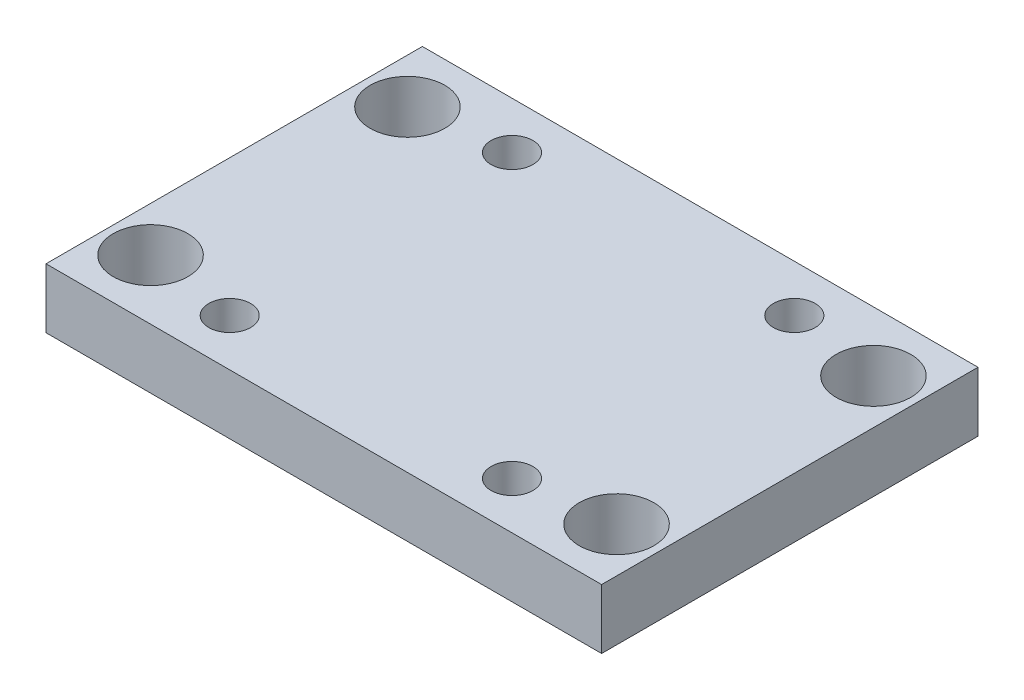
ISO-10303-21;
HEADER;
FILE_DESCRIPTION(('STEP AP214'),'2;1');
FILE_NAME('part.step','',(''),(''),'','','');
FILE_SCHEMA(('AUTOMOTIVE_DESIGN { 1 0 10303 214 1 1 1 1 }'));
ENDSEC;
DATA;
#1=APPLICATION_CONTEXT('core data for automotive mechanical design processes');
#2=APPLICATION_PROTOCOL_DEFINITION('international standard','automotive_design',2000,#1);
#3=PRODUCT_CONTEXT('',#1,'mechanical');
#4=PRODUCT('Part','Part','',(#3));
#5=PRODUCT_RELATED_PRODUCT_CATEGORY('part','',(#4));
#6=PRODUCT_DEFINITION_FORMATION('','',#4);
#7=PRODUCT_DEFINITION_CONTEXT('part definition',#1,'design');
#8=PRODUCT_DEFINITION('design','',#6,#7);
#9=PRODUCT_DEFINITION_SHAPE('','',#8);
#10=(LENGTH_UNIT() NAMED_UNIT(*) SI_UNIT(.MILLI.,.METRE.));
#11=(NAMED_UNIT(*) PLANE_ANGLE_UNIT() SI_UNIT($,.RADIAN.));
#12=(NAMED_UNIT(*) SI_UNIT($,.STERADIAN.) SOLID_ANGLE_UNIT());
#13=UNCERTAINTY_MEASURE_WITH_UNIT(LENGTH_MEASURE(1.E-05),#10,'distance_accuracy_value','');
#14=(GEOMETRIC_REPRESENTATION_CONTEXT(3) GLOBAL_UNCERTAINTY_ASSIGNED_CONTEXT((#13)) GLOBAL_UNIT_ASSIGNED_CONTEXT((#10,
#11,#12)) REPRESENTATION_CONTEXT('',''));
#15=CARTESIAN_POINT('',(0.,0.,0.));
#16=DIRECTION('',(0.,0.,1.));
#17=DIRECTION('',(1.,0.,0.));
#18=AXIS2_PLACEMENT_3D('',#15,#16,#17);
#19=CARTESIAN_POINT('',(59.055,12.7,-40.005));
#20=DIRECTION('',(-1.,0.,0.));
#21=DIRECTION('',(0.,0.,1.));
#22=AXIS2_PLACEMENT_3D('',#19,#20,#21);
#23=PLANE('',#22);
#24=DIRECTION('',(0.,0.,-1.));
#25=VECTOR('',#24,1.);
#26=CARTESIAN_POINT('',(59.055,0.,-40.005));
#27=LINE('',#26,#25);
#28=CARTESIAN_POINT('',(59.055,0.,40.005));
#29=VERTEX_POINT('',#28);
#30=CARTESIAN_POINT('',(59.055,0.,-40.005));
#31=VERTEX_POINT('',#30);
#32=EDGE_CURVE('E96',#29,#31,#27,.T.);
#33=ORIENTED_EDGE('',*,*,#32,.T.);
#34=DIRECTION('',(0.,-1.,0.));
#35=VECTOR('',#34,1.);
#36=CARTESIAN_POINT('',(59.055,12.7,-40.005));
#37=LINE('',#36,#35);
#38=CARTESIAN_POINT('',(59.055,12.7,-40.005));
#39=VERTEX_POINT('',#38);
#40=EDGE_CURVE('E11',#39,#31,#37,.T.);
#41=ORIENTED_EDGE('',*,*,#40,.F.);
#42=DIRECTION('',(0.,0.,-1.));
#43=VECTOR('',#42,1.);
#44=CARTESIAN_POINT('',(59.055,12.7,-40.005));
#45=LINE('',#44,#43);
#46=CARTESIAN_POINT('',(59.055,12.7,40.005));
#47=VERTEX_POINT('',#46);
#48=EDGE_CURVE('E84',#47,#39,#45,.T.);
#49=ORIENTED_EDGE('',*,*,#48,.F.);
#50=DIRECTION('',(0.,-1.,0.));
#51=VECTOR('',#50,1.);
#52=CARTESIAN_POINT('',(59.055,12.7,40.005));
#53=LINE('',#52,#51);
#54=EDGE_CURVE('E92',#47,#29,#53,.T.);
#55=ORIENTED_EDGE('',*,*,#54,.T.);
#56=EDGE_LOOP('',(#33,#41,#49,#55));
#57=FACE_BOUND('',#56,.T.);
#58=ADVANCED_FACE('F33',(#57),#23,.F.);
#59=CARTESIAN_POINT('',(-59.055,12.7,-40.005));
#60=DIRECTION('',(0.,0.,1.));
#61=DIRECTION('',(1.,0.,0.));
#62=AXIS2_PLACEMENT_3D('',#59,#60,#61);
#63=PLANE('',#62);
#64=DIRECTION('',(-1.,0.,0.));
#65=VECTOR('',#64,1.);
#66=CARTESIAN_POINT('',(-59.055,0.,-40.005));
#67=LINE('',#66,#65);
#68=CARTESIAN_POINT('',(-59.055,0.,-40.005));
#69=VERTEX_POINT('',#68);
#70=EDGE_CURVE('E88',#31,#69,#67,.T.);
#71=ORIENTED_EDGE('',*,*,#70,.T.);
#72=DIRECTION('',(0.,-1.,0.));
#73=VECTOR('',#72,1.);
#74=CARTESIAN_POINT('',(-59.055,12.7,-40.005));
#75=LINE('',#74,#73);
#76=CARTESIAN_POINT('',(-59.055,12.7,-40.005));
#77=VERTEX_POINT('',#76);
#78=EDGE_CURVE('E41',#77,#69,#75,.T.);
#79=ORIENTED_EDGE('',*,*,#78,.F.);
#80=DIRECTION('',(-1.,0.,0.));
#81=VECTOR('',#80,1.);
#82=CARTESIAN_POINT('',(-59.055,12.7,-40.005));
#83=LINE('',#82,#81);
#84=EDGE_CURVE('E79',#39,#77,#83,.T.);
#85=ORIENTED_EDGE('',*,*,#84,.F.);
#86=ORIENTED_EDGE('',*,*,#40,.T.);
#87=EDGE_LOOP('',(#71,#79,#85,#86));
#88=FACE_BOUND('',#87,.T.);
#89=ADVANCED_FACE('F87',(#88),#63,.F.);
#90=CARTESIAN_POINT('',(-59.055,12.7,-40.005));
#91=DIRECTION('',(1.,0.,0.));
#92=DIRECTION('',(0.,0.,-1.));
#93=AXIS2_PLACEMENT_3D('',#90,#91,#92);
#94=PLANE('',#93);
#95=DIRECTION('',(0.,0.,1.));
#96=VECTOR('',#95,1.);
#97=CARTESIAN_POINT('',(-59.055,0.,-40.005));
#98=LINE('',#97,#96);
#99=CARTESIAN_POINT('',(-59.055,0.,40.005));
#100=VERTEX_POINT('',#99);
#101=EDGE_CURVE('E66',#69,#100,#98,.T.);
#102=ORIENTED_EDGE('',*,*,#101,.T.);
#103=DIRECTION('',(0.,-1.,0.));
#104=VECTOR('',#103,1.);
#105=CARTESIAN_POINT('',(-59.055,12.7,40.005));
#106=LINE('',#105,#104);
#107=CARTESIAN_POINT('',(-59.055,12.7,40.005));
#108=VERTEX_POINT('',#107);
#109=EDGE_CURVE('E89',#108,#100,#106,.T.);
#110=ORIENTED_EDGE('',*,*,#109,.F.);
#111=DIRECTION('',(0.,0.,1.));
#112=VECTOR('',#111,1.);
#113=CARTESIAN_POINT('',(-59.055,12.7,-40.005));
#114=LINE('',#113,#112);
#115=EDGE_CURVE('E82',#77,#108,#114,.T.);
#116=ORIENTED_EDGE('',*,*,#115,.F.);
#117=ORIENTED_EDGE('',*,*,#78,.T.);
#118=EDGE_LOOP('',(#102,#110,#116,#117));
#119=FACE_BOUND('',#118,.T.);
#120=ADVANCED_FACE('F90',(#119),#94,.F.);
#121=CARTESIAN_POINT('',(-59.055,12.7,40.005));
#122=DIRECTION('',(0.,0.,-1.));
#123=DIRECTION('',(-1.,0.,0.));
#124=AXIS2_PLACEMENT_3D('',#121,#122,#123);
#125=PLANE('',#124);
#126=DIRECTION('',(1.,0.,0.));
#127=VECTOR('',#126,1.);
#128=CARTESIAN_POINT('',(-59.055,0.,40.005));
#129=LINE('',#128,#127);
#130=EDGE_CURVE('E72',#100,#29,#129,.T.);
#131=ORIENTED_EDGE('',*,*,#130,.T.);
#132=ORIENTED_EDGE('',*,*,#54,.F.);
#133=DIRECTION('',(1.,0.,0.));
#134=VECTOR('',#133,1.);
#135=CARTESIAN_POINT('',(-59.055,12.7,40.005));
#136=LINE('',#135,#134);
#137=EDGE_CURVE('E49',#108,#47,#136,.T.);
#138=ORIENTED_EDGE('',*,*,#137,.F.);
#139=ORIENTED_EDGE('',*,*,#109,.T.);
#140=EDGE_LOOP('',(#131,#132,#138,#139));
#141=FACE_BOUND('',#140,.T.);
#142=ADVANCED_FACE('F104',(#141),#125,.F.);
#143=CARTESIAN_POINT('',(0.,12.7,0.));
#144=DIRECTION('',(0.,1.,0.));
#145=DIRECTION('',(0.,0.,1.));
#146=AXIS2_PLACEMENT_3D('',#143,#144,#145);
#147=PLANE('',#146);
#148=CARTESIAN_POINT('',(49.53,12.7,27.305));
#149=DIRECTION('',(0.,-1.,0.));
#150=DIRECTION('',(0.,0.,-1.));
#151=AXIS2_PLACEMENT_3D('',#148,#149,#150);
#152=CIRCLE('',#151,7.9375);
#153=CARTESIAN_POINT('',(49.53,12.7,19.3675));
#154=VERTEX_POINT('',#153);
#155=EDGE_CURVE('E143',#154,#154,#152,.T.);
#156=ORIENTED_EDGE('',*,*,#155,.T.);
#157=EDGE_LOOP('',(#156));
#158=FACE_BOUND('',#157,.T.);
#159=CARTESIAN_POINT('',(49.53,12.7,-27.305));
#160=DIRECTION('',(0.,-1.,0.));
#161=DIRECTION('',(0.,0.,-1.));
#162=AXIS2_PLACEMENT_3D('',#159,#160,#161);
#163=CIRCLE('',#162,7.93749999999999);
#164=CARTESIAN_POINT('',(49.53,12.7,-35.2425));
#165=VERTEX_POINT('',#164);
#166=EDGE_CURVE('E149',#165,#165,#163,.T.);
#167=ORIENTED_EDGE('',*,*,#166,.T.);
#168=EDGE_LOOP('',(#167));
#169=FACE_BOUND('',#168,.T.);
#170=CARTESIAN_POINT('',(-49.53,12.7,-27.305));
#171=DIRECTION('',(0.,-1.,0.));
#172=DIRECTION('',(0.,0.,-1.));
#173=AXIS2_PLACEMENT_3D('',#170,#171,#172);
#174=CIRCLE('',#173,7.9375);
#175=CARTESIAN_POINT('',(-49.53,12.7,-35.2425));
#176=VERTEX_POINT('',#175);
#177=EDGE_CURVE('E137',#176,#176,#174,.T.);
#178=ORIENTED_EDGE('',*,*,#177,.T.);
#179=EDGE_LOOP('',(#178));
#180=FACE_BOUND('',#179,.T.);
#181=CARTESIAN_POINT('',(-49.53,12.7,27.305));
#182=DIRECTION('',(0.,-1.,0.));
#183=DIRECTION('',(0.,0.,-1.));
#184=AXIS2_PLACEMENT_3D('',#181,#182,#183);
#185=CIRCLE('',#184,7.9375);
#186=CARTESIAN_POINT('',(-49.53,12.7,19.3675));
#187=VERTEX_POINT('',#186);
#188=EDGE_CURVE('E131',#187,#187,#185,.T.);
#189=ORIENTED_EDGE('',*,*,#188,.T.);
#190=EDGE_LOOP('',(#189));
#191=FACE_BOUND('',#190,.T.);
#192=CARTESIAN_POINT('',(30.00502,12.7,30.00502));
#193=DIRECTION('',(0.,-1.,0.));
#194=DIRECTION('',(0.,0.,-1.));
#195=AXIS2_PLACEMENT_3D('',#192,#193,#194);
#196=CIRCLE('',#195,4.445);
#197=CARTESIAN_POINT('',(30.00502,12.7,25.56002));
#198=VERTEX_POINT('',#197);
#199=EDGE_CURVE('E113',#198,#198,#196,.T.);
#200=ORIENTED_EDGE('',*,*,#199,.T.);
#201=EDGE_LOOP('',(#200));
#202=FACE_BOUND('',#201,.T.);
#203=CARTESIAN_POINT('',(-30.00502,12.7,-30.00502));
#204=DIRECTION('',(0.,-1.,0.));
#205=DIRECTION('',(0.,0.,-1.));
#206=AXIS2_PLACEMENT_3D('',#203,#204,#205);
#207=CIRCLE('',#206,4.44499999999999);
#208=CARTESIAN_POINT('',(-30.00502,12.7,-34.45002));
#209=VERTEX_POINT('',#208);
#210=EDGE_CURVE('E119',#209,#209,#207,.T.);
#211=ORIENTED_EDGE('',*,*,#210,.T.);
#212=EDGE_LOOP('',(#211));
#213=FACE_BOUND('',#212,.T.);
#214=CARTESIAN_POINT('',(30.00502,12.7,-30.00502));
#215=DIRECTION('',(0.,-1.,0.));
#216=DIRECTION('',(0.,0.,-1.));
#217=AXIS2_PLACEMENT_3D('',#214,#215,#216);
#218=CIRCLE('',#217,4.44499999999999);
#219=CARTESIAN_POINT('',(30.00502,12.7,-34.45002));
#220=VERTEX_POINT('',#219);
#221=EDGE_CURVE('E120',#220,#220,#218,.T.);
#222=ORIENTED_EDGE('',*,*,#221,.T.);
#223=EDGE_LOOP('',(#222));
#224=FACE_BOUND('',#223,.T.);
#225=CARTESIAN_POINT('',(-30.00502,12.7,30.00502));
#226=DIRECTION('',(0.,-1.,0.));
#227=DIRECTION('',(0.,0.,-1.));
#228=AXIS2_PLACEMENT_3D('',#225,#226,#227);
#229=CIRCLE('',#228,4.445);
#230=CARTESIAN_POINT('',(-30.00502,12.7,25.56002));
#231=VERTEX_POINT('',#230);
#232=EDGE_CURVE('E99',#231,#231,#229,.T.);
#233=ORIENTED_EDGE('',*,*,#232,.T.);
#234=EDGE_LOOP('',(#233));
#235=FACE_BOUND('',#234,.T.);
#236=ORIENTED_EDGE('',*,*,#48,.T.);
#237=ORIENTED_EDGE('',*,*,#84,.T.);
#238=ORIENTED_EDGE('',*,*,#115,.T.);
#239=ORIENTED_EDGE('',*,*,#137,.T.);
#240=EDGE_LOOP('',(#236,#237,#238,#239));
#241=FACE_BOUND('',#240,.T.);
#242=ADVANCED_FACE('F80',(#158,#169,#180,#191,#202,#213,#224,#235,#241),#147,.T.);
#243=CARTESIAN_POINT('',(0.,0.,0.));
#244=DIRECTION('',(0.,1.,0.));
#245=DIRECTION('',(0.,0.,1.));
#246=AXIS2_PLACEMENT_3D('',#243,#244,#245);
#247=PLANE('',#246);
#248=CARTESIAN_POINT('',(49.53,0.,27.305));
#249=DIRECTION('',(0.,-1.,0.));
#250=DIRECTION('',(0.,0.,-1.));
#251=AXIS2_PLACEMENT_3D('',#248,#249,#250);
#252=CIRCLE('',#251,7.9375);
#253=CARTESIAN_POINT('',(49.53,0.,19.3675));
#254=VERTEX_POINT('',#253);
#255=EDGE_CURVE('E140',#254,#254,#252,.T.);
#256=ORIENTED_EDGE('',*,*,#255,.F.);
#257=EDGE_LOOP('',(#256));
#258=FACE_BOUND('',#257,.T.);
#259=CARTESIAN_POINT('',(49.53,0.,-27.305));
#260=DIRECTION('',(0.,-1.,0.));
#261=DIRECTION('',(0.,0.,-1.));
#262=AXIS2_PLACEMENT_3D('',#259,#260,#261);
#263=CIRCLE('',#262,7.93749999999999);
#264=CARTESIAN_POINT('',(49.53,0.,-35.2425));
#265=VERTEX_POINT('',#264);
#266=EDGE_CURVE('E146',#265,#265,#263,.T.);
#267=ORIENTED_EDGE('',*,*,#266,.F.);
#268=EDGE_LOOP('',(#267));
#269=FACE_BOUND('',#268,.T.);
#270=CARTESIAN_POINT('',(-49.53,0.,-27.305));
#271=DIRECTION('',(0.,-1.,0.));
#272=DIRECTION('',(0.,0.,-1.));
#273=AXIS2_PLACEMENT_3D('',#270,#271,#272);
#274=CIRCLE('',#273,7.9375);
#275=CARTESIAN_POINT('',(-49.53,0.,-35.2425));
#276=VERTEX_POINT('',#275);
#277=EDGE_CURVE('E152',#276,#276,#274,.T.);
#278=ORIENTED_EDGE('',*,*,#277,.F.);
#279=EDGE_LOOP('',(#278));
#280=FACE_BOUND('',#279,.T.);
#281=CARTESIAN_POINT('',(-49.53,0.,27.305));
#282=DIRECTION('',(0.,-1.,0.));
#283=DIRECTION('',(0.,0.,-1.));
#284=AXIS2_PLACEMENT_3D('',#281,#282,#283);
#285=CIRCLE('',#284,7.9375);
#286=CARTESIAN_POINT('',(-49.53,0.,19.3675));
#287=VERTEX_POINT('',#286);
#288=EDGE_CURVE('E134',#287,#287,#285,.T.);
#289=ORIENTED_EDGE('',*,*,#288,.F.);
#290=EDGE_LOOP('',(#289));
#291=FACE_BOUND('',#290,.T.);
#292=CARTESIAN_POINT('',(30.00502,0.,30.00502));
#293=DIRECTION('',(0.,-1.,0.));
#294=DIRECTION('',(0.,0.,-1.));
#295=AXIS2_PLACEMENT_3D('',#292,#293,#294);
#296=CIRCLE('',#295,4.445);
#297=CARTESIAN_POINT('',(30.00502,0.,25.56002));
#298=VERTEX_POINT('',#297);
#299=EDGE_CURVE('E123',#298,#298,#296,.T.);
#300=ORIENTED_EDGE('',*,*,#299,.F.);
#301=EDGE_LOOP('',(#300));
#302=FACE_BOUND('',#301,.T.);
#303=CARTESIAN_POINT('',(-30.00502,0.,-30.00502));
#304=DIRECTION('',(0.,-1.,0.));
#305=DIRECTION('',(0.,0.,-1.));
#306=AXIS2_PLACEMENT_3D('',#303,#304,#305);
#307=CIRCLE('',#306,4.44499999999999);
#308=CARTESIAN_POINT('',(-30.00502,0.,-34.45002));
#309=VERTEX_POINT('',#308);
#310=EDGE_CURVE('E116',#309,#309,#307,.T.);
#311=ORIENTED_EDGE('',*,*,#310,.F.);
#312=EDGE_LOOP('',(#311));
#313=FACE_BOUND('',#312,.T.);
#314=CARTESIAN_POINT('',(30.00502,0.,-30.00502));
#315=DIRECTION('',(0.,-1.,0.));
#316=DIRECTION('',(0.,0.,-1.));
#317=AXIS2_PLACEMENT_3D('',#314,#315,#316);
#318=CIRCLE('',#317,4.44499999999999);
#319=CARTESIAN_POINT('',(30.00502,0.,-34.45002));
#320=VERTEX_POINT('',#319);
#321=EDGE_CURVE('E128',#320,#320,#318,.T.);
#322=ORIENTED_EDGE('',*,*,#321,.F.);
#323=EDGE_LOOP('',(#322));
#324=FACE_BOUND('',#323,.T.);
#325=CARTESIAN_POINT('',(-30.00502,0.,30.00502));
#326=DIRECTION('',(0.,-1.,0.));
#327=DIRECTION('',(0.,0.,-1.));
#328=AXIS2_PLACEMENT_3D('',#325,#326,#327);
#329=CIRCLE('',#328,4.445);
#330=CARTESIAN_POINT('',(-30.00502,0.,25.56002));
#331=VERTEX_POINT('',#330);
#332=EDGE_CURVE('E110',#331,#331,#329,.T.);
#333=ORIENTED_EDGE('',*,*,#332,.F.);
#334=EDGE_LOOP('',(#333));
#335=FACE_BOUND('',#334,.T.);
#336=ORIENTED_EDGE('',*,*,#32,.F.);
#337=ORIENTED_EDGE('',*,*,#130,.F.);
#338=ORIENTED_EDGE('',*,*,#101,.F.);
#339=ORIENTED_EDGE('',*,*,#70,.F.);
#340=EDGE_LOOP('',(#336,#337,#338,#339));
#341=FACE_BOUND('',#340,.T.);
#342=ADVANCED_FACE('F107',(#258,#269,#280,#291,#302,#313,#324,#335,#341),#247,.F.);
#343=CARTESIAN_POINT('',(-30.00502,12.7,30.00502));
#344=DIRECTION('',(0.,-1.,0.));
#345=DIRECTION('',(0.,0.,-1.));
#346=AXIS2_PLACEMENT_3D('',#343,#344,#345);
#347=CYLINDRICAL_SURFACE('',#346,4.445);
#348=ORIENTED_EDGE('',*,*,#232,.F.);
#349=EDGE_LOOP('',(#348));
#350=FACE_BOUND('',#349,.T.);
#351=ORIENTED_EDGE('',*,*,#332,.T.);
#352=EDGE_LOOP('',(#351));
#353=FACE_BOUND('',#352,.T.);
#354=ADVANCED_FACE('F170',(#350,#353),#347,.F.);
#355=CARTESIAN_POINT('',(30.00502,12.7,-30.00502));
#356=DIRECTION('',(0.,-1.,0.));
#357=DIRECTION('',(0.,0.,-1.));
#358=AXIS2_PLACEMENT_3D('',#355,#356,#357);
#359=CYLINDRICAL_SURFACE('',#358,4.44499999999999);
#360=ORIENTED_EDGE('',*,*,#221,.F.);
#361=EDGE_LOOP('',(#360));
#362=FACE_BOUND('',#361,.T.);
#363=ORIENTED_EDGE('',*,*,#321,.T.);
#364=EDGE_LOOP('',(#363));
#365=FACE_BOUND('',#364,.T.);
#366=ADVANCED_FACE('F184',(#362,#365),#359,.F.);
#367=CARTESIAN_POINT('',(-30.00502,12.7,-30.00502));
#368=DIRECTION('',(0.,-1.,0.));
#369=DIRECTION('',(0.,0.,-1.));
#370=AXIS2_PLACEMENT_3D('',#367,#368,#369);
#371=CYLINDRICAL_SURFACE('',#370,4.44499999999999);
#372=ORIENTED_EDGE('',*,*,#210,.F.);
#373=EDGE_LOOP('',(#372));
#374=FACE_BOUND('',#373,.T.);
#375=ORIENTED_EDGE('',*,*,#310,.T.);
#376=EDGE_LOOP('',(#375));
#377=FACE_BOUND('',#376,.T.);
#378=ADVANCED_FACE('F190',(#374,#377),#371,.F.);
#379=CARTESIAN_POINT('',(30.00502,12.7,30.00502));
#380=DIRECTION('',(0.,-1.,0.));
#381=DIRECTION('',(0.,0.,-1.));
#382=AXIS2_PLACEMENT_3D('',#379,#380,#381);
#383=CYLINDRICAL_SURFACE('',#382,4.445);
#384=ORIENTED_EDGE('',*,*,#199,.F.);
#385=EDGE_LOOP('',(#384));
#386=FACE_BOUND('',#385,.T.);
#387=ORIENTED_EDGE('',*,*,#299,.T.);
#388=EDGE_LOOP('',(#387));
#389=FACE_BOUND('',#388,.T.);
#390=ADVANCED_FACE('F227',(#386,#389),#383,.F.);
#391=CARTESIAN_POINT('',(-49.53,12.7,27.305));
#392=DIRECTION('',(0.,-1.,0.));
#393=DIRECTION('',(0.,0.,-1.));
#394=AXIS2_PLACEMENT_3D('',#391,#392,#393);
#395=CYLINDRICAL_SURFACE('',#394,7.9375);
#396=ORIENTED_EDGE('',*,*,#188,.F.);
#397=EDGE_LOOP('',(#396));
#398=FACE_BOUND('',#397,.T.);
#399=ORIENTED_EDGE('',*,*,#288,.T.);
#400=EDGE_LOOP('',(#399));
#401=FACE_BOUND('',#400,.T.);
#402=ADVANCED_FACE('F164',(#398,#401),#395,.F.);
#403=CARTESIAN_POINT('',(-49.53,12.7,-27.305));
#404=DIRECTION('',(0.,-1.,0.));
#405=DIRECTION('',(0.,0.,-1.));
#406=AXIS2_PLACEMENT_3D('',#403,#404,#405);
#407=CYLINDRICAL_SURFACE('',#406,7.9375);
#408=ORIENTED_EDGE('',*,*,#177,.F.);
#409=EDGE_LOOP('',(#408));
#410=FACE_BOUND('',#409,.T.);
#411=ORIENTED_EDGE('',*,*,#277,.T.);
#412=EDGE_LOOP('',(#411));
#413=FACE_BOUND('',#412,.T.);
#414=ADVANCED_FACE('F160',(#410,#413),#407,.F.);
#415=CARTESIAN_POINT('',(49.53,12.7,-27.305));
#416=DIRECTION('',(0.,-1.,0.));
#417=DIRECTION('',(0.,0.,-1.));
#418=AXIS2_PLACEMENT_3D('',#415,#416,#417);
#419=CYLINDRICAL_SURFACE('',#418,7.93749999999999);
#420=ORIENTED_EDGE('',*,*,#166,.F.);
#421=EDGE_LOOP('',(#420));
#422=FACE_BOUND('',#421,.T.);
#423=ORIENTED_EDGE('',*,*,#266,.T.);
#424=EDGE_LOOP('',(#423));
#425=FACE_BOUND('',#424,.T.);
#426=ADVANCED_FACE('F163',(#422,#425),#419,.F.);
#427=CARTESIAN_POINT('',(49.53,12.7,27.305));
#428=DIRECTION('',(0.,-1.,0.));
#429=DIRECTION('',(0.,0.,-1.));
#430=AXIS2_PLACEMENT_3D('',#427,#428,#429);
#431=CYLINDRICAL_SURFACE('',#430,7.9375);
#432=ORIENTED_EDGE('',*,*,#155,.F.);
#433=EDGE_LOOP('',(#432));
#434=FACE_BOUND('',#433,.T.);
#435=ORIENTED_EDGE('',*,*,#255,.T.);
#436=EDGE_LOOP('',(#435));
#437=FACE_BOUND('',#436,.T.);
#438=ADVANCED_FACE('F216',(#434,#437),#431,.F.);
#439=CLOSED_SHELL('',(#58,#89,#120,#142,#242,#342,#354,#366,#378,#390,#402,#414,#426,#438));
#440=MANIFOLD_SOLID_BREP('B2',#439);
#441=ADVANCED_BREP_SHAPE_REPRESENTATION('',(#18,#440),#14);
#442=SHAPE_DEFINITION_REPRESENTATION(#9,#441);
ENDSEC;
END-ISO-10303-21;
